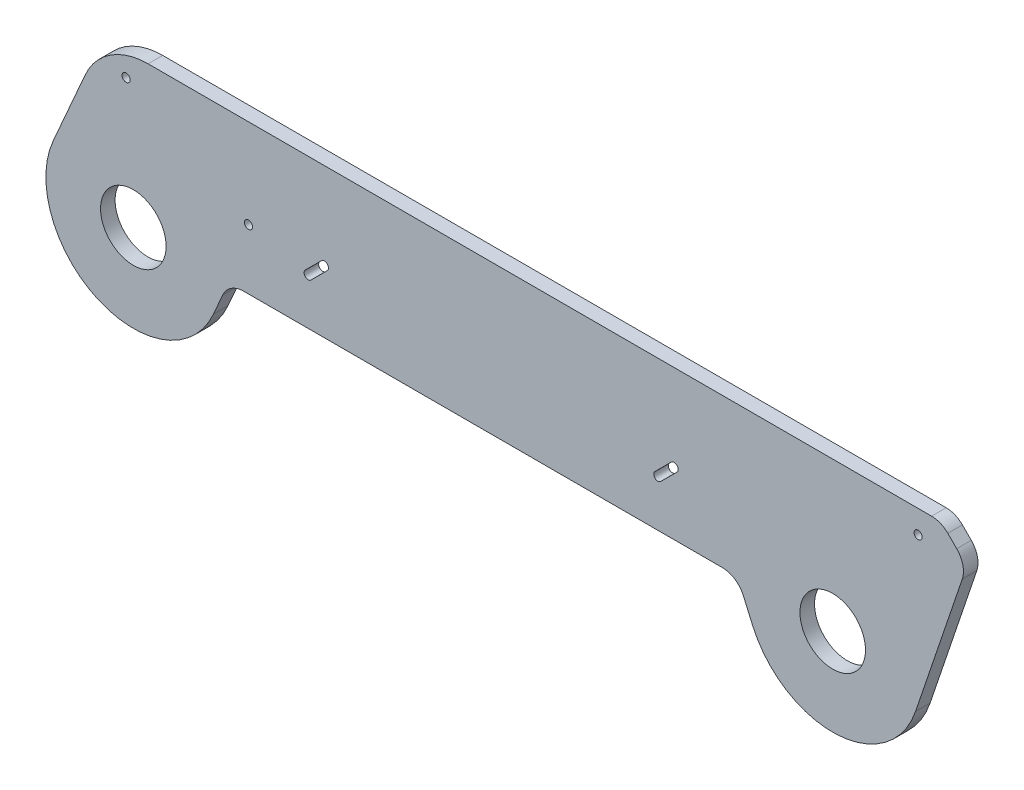
ISO-10303-21;
HEADER;
FILE_DESCRIPTION(('STEP AP214'),'2;1');
FILE_NAME('part.step','',(''),(''),'','','');
FILE_SCHEMA(('AUTOMOTIVE_DESIGN { 1 0 10303 214 1 1 1 1 }'));
ENDSEC;
DATA;
#1=APPLICATION_CONTEXT('core data for automotive mechanical design processes');
#2=APPLICATION_PROTOCOL_DEFINITION('international standard','automotive_design',2000,#1);
#3=PRODUCT_CONTEXT('',#1,'mechanical');
#4=PRODUCT('Part','Part','',(#3));
#5=PRODUCT_RELATED_PRODUCT_CATEGORY('part','',(#4));
#6=PRODUCT_DEFINITION_FORMATION('','',#4);
#7=PRODUCT_DEFINITION_CONTEXT('part definition',#1,'design');
#8=PRODUCT_DEFINITION('design','',#6,#7);
#9=PRODUCT_DEFINITION_SHAPE('','',#8);
#10=(LENGTH_UNIT() NAMED_UNIT(*) SI_UNIT(.MILLI.,.METRE.));
#11=(NAMED_UNIT(*) PLANE_ANGLE_UNIT() SI_UNIT($,.RADIAN.));
#12=(NAMED_UNIT(*) SI_UNIT($,.STERADIAN.) SOLID_ANGLE_UNIT());
#13=UNCERTAINTY_MEASURE_WITH_UNIT(LENGTH_MEASURE(1.E-05),#10,'distance_accuracy_value','');
#14=(GEOMETRIC_REPRESENTATION_CONTEXT(3) GLOBAL_UNCERTAINTY_ASSIGNED_CONTEXT((#13)) GLOBAL_UNIT_ASSIGNED_CONTEXT((#10,
#11,#12)) REPRESENTATION_CONTEXT('',''));
#15=CARTESIAN_POINT('',(0.,0.,0.));
#16=DIRECTION('',(0.,0.,1.));
#17=DIRECTION('',(1.,0.,0.));
#18=AXIS2_PLACEMENT_3D('',#15,#16,#17);
#19=CARTESIAN_POINT('',(0.,0.,6.35));
#20=DIRECTION('',(0.,0.,1.));
#21=DIRECTION('',(1.,0.,0.));
#22=AXIS2_PLACEMENT_3D('',#19,#20,#21);
#23=PLANE('',#22);
#24=CARTESIAN_POINT('',(50.2,26.1640236911096,6.34999999999999));
#25=DIRECTION('',(0.,0.,1.));
#26=DIRECTION('',(1.,0.,0.));
#27=AXIS2_PLACEMENT_3D('',#24,#25,#26);
#28=CIRCLE('',#27,1.778);
#29=CARTESIAN_POINT('',(51.978,26.1640236911096,6.34999999999999));
#30=VERTEX_POINT('',#29);
#31=EDGE_CURVE('E578',#30,#30,#28,.F.);
#32=ORIENTED_EDGE('',*,*,#31,.T.);
#33=EDGE_LOOP('',(#32));
#34=FACE_BOUND('',#33,.T.);
#35=CARTESIAN_POINT('',(0.,0.,6.35));
#36=DIRECTION('',(0.,0.,1.));
#37=DIRECTION('',(1.,0.,0.));
#38=AXIS2_PLACEMENT_3D('',#35,#36,#37);
#39=CIRCLE('',#38,14.2875);
#40=CARTESIAN_POINT('',(14.2875,0.,6.35));
#41=VERTEX_POINT('',#40);
#42=EDGE_CURVE('E397',#41,#41,#39,.T.);
#43=ORIENTED_EDGE('',*,*,#42,.F.);
#44=EDGE_LOOP('',(#43));
#45=FACE_BOUND('',#44,.T.);
#46=CARTESIAN_POINT('',(304.8,0.,6.35));
#47=DIRECTION('',(0.,0.,1.));
#48=DIRECTION('',(1.,0.,0.));
#49=AXIS2_PLACEMENT_3D('',#46,#47,#48);
#50=CIRCLE('',#49,14.2875);
#51=CARTESIAN_POINT('',(319.0875,0.,6.35));
#52=VERTEX_POINT('',#51);
#53=EDGE_CURVE('E400',#52,#52,#50,.T.);
#54=ORIENTED_EDGE('',*,*,#53,.F.);
#55=EDGE_LOOP('',(#54));
#56=FACE_BOUND('',#55,.T.);
#57=DIRECTION('',(-0.707106781186547,-0.707106781186548,0.));
#58=VECTOR('',#57,1.);
#59=CARTESIAN_POINT('',(227.34276414305,21.5848354973704,6.35));
#60=LINE('',#59,#58);
#61=CARTESIAN_POINT('',(234.413831954916,28.6559033092359,6.35));
#62=VERTEX_POINT('',#61);
#63=CARTESIAN_POINT('',(227.34276414305,21.5848354973704,6.35));
#64=VERTEX_POINT('',#63);
#65=EDGE_CURVE('E604',#62,#64,#60,.T.);
#66=ORIENTED_EDGE('',*,*,#65,.F.);
#67=CARTESIAN_POINT('',(235.671067811866,27.3986674522862,6.35));
#68=DIRECTION('',(0.,0.,1.));
#69=DIRECTION('',(1.,0.,0.));
#70=AXIS2_PLACEMENT_3D('',#67,#68,#69);
#71=CIRCLE('',#70,1.77799999999999);
#72=CARTESIAN_POINT('',(236.928303668815,26.1414315953365,6.35));
#73=VERTEX_POINT('',#72);
#74=EDGE_CURVE('E601',#73,#62,#71,.T.);
#75=ORIENTED_EDGE('',*,*,#74,.F.);
#76=DIRECTION('',(0.707106781186547,0.707106781186547,0.));
#77=VECTOR('',#76,1.);
#78=CARTESIAN_POINT('',(229.85723585695,19.070363783471,6.35));
#79=LINE('',#78,#77);
#80=CARTESIAN_POINT('',(229.85723585695,19.070363783471,6.35));
#81=VERTEX_POINT('',#80);
#82=EDGE_CURVE('E583',#81,#73,#79,.T.);
#83=ORIENTED_EDGE('',*,*,#82,.F.);
#84=CARTESIAN_POINT('',(228.6,20.3275996404207,6.35));
#85=DIRECTION('',(0.,0.,1.));
#86=DIRECTION('',(1.,0.,0.));
#87=AXIS2_PLACEMENT_3D('',#84,#85,#86);
#88=CIRCLE('',#87,1.77800000000001);
#89=EDGE_CURVE('E616',#64,#81,#88,.T.);
#90=ORIENTED_EDGE('',*,*,#89,.F.);
#91=EDGE_LOOP('',(#66,#75,#83,#90));
#92=FACE_BOUND('',#91,.T.);
#93=DIRECTION('',(-0.707106781186548,-0.707106781186547,0.));
#94=VECTOR('',#93,1.);
#95=CARTESIAN_POINT('',(74.9427641430503,21.4212595480593,6.35));
#96=LINE('',#95,#94);
#97=CARTESIAN_POINT('',(82.0138319549158,28.4923273599247,6.35));
#98=VERTEX_POINT('',#97);
#99=CARTESIAN_POINT('',(74.9427641430503,21.4212595480593,6.35));
#100=VERTEX_POINT('',#99);
#101=EDGE_CURVE('E592',#98,#100,#96,.T.);
#102=ORIENTED_EDGE('',*,*,#101,.F.);
#103=CARTESIAN_POINT('',(83.2710678118655,27.2350915029751,6.35));
#104=DIRECTION('',(0.,0.,1.));
#105=DIRECTION('',(1.,0.,0.));
#106=AXIS2_PLACEMENT_3D('',#103,#104,#105);
#107=CIRCLE('',#106,1.778);
#108=CARTESIAN_POINT('',(84.5283036688151,25.9778556460254,6.35));
#109=VERTEX_POINT('',#108);
#110=EDGE_CURVE('E588',#109,#98,#107,.T.);
#111=ORIENTED_EDGE('',*,*,#110,.F.);
#112=DIRECTION('',(0.707106781186547,0.707106781186548,0.));
#113=VECTOR('',#112,1.);
#114=CARTESIAN_POINT('',(77.4572358569497,18.9067878341599,6.35));
#115=LINE('',#114,#113);
#116=CARTESIAN_POINT('',(77.4572358569497,18.9067878341599,6.35));
#117=VERTEX_POINT('',#116);
#118=EDGE_CURVE('E585',#117,#109,#115,.T.);
#119=ORIENTED_EDGE('',*,*,#118,.F.);
#120=CARTESIAN_POINT('',(76.2,20.1640236911096,6.35));
#121=DIRECTION('',(0.,0.,1.));
#122=DIRECTION('',(1.,0.,0.));
#123=AXIS2_PLACEMENT_3D('',#120,#121,#122);
#124=CIRCLE('',#123,1.77800000000001);
#125=EDGE_CURVE('E427',#100,#117,#124,.T.);
#126=ORIENTED_EDGE('',*,*,#125,.F.);
#127=EDGE_LOOP('',(#102,#111,#119,#126));
#128=FACE_BOUND('',#127,.T.);
#129=CARTESIAN_POINT('',(342.032717470029,55.,6.35));
#130=DIRECTION('',(0.,0.,-1.));
#131=DIRECTION('',(-1.,0.,0.));
#132=AXIS2_PLACEMENT_3D('',#129,#130,#131);
#133=CIRCLE('',#132,1.77800000000004);
#134=CARTESIAN_POINT('',(340.254717470029,55.,6.35));
#135=VERTEX_POINT('',#134);
#136=EDGE_CURVE('E385',#135,#135,#133,.T.);
#137=ORIENTED_EDGE('',*,*,#136,.T.);
#138=EDGE_LOOP('',(#137));
#139=FACE_BOUND('',#138,.T.);
#140=CARTESIAN_POINT('',(-3.15136382807367,55.,6.35));
#141=DIRECTION('',(0.,0.,-1.));
#142=DIRECTION('',(1.,0.,0.));
#143=AXIS2_PLACEMENT_3D('',#140,#141,#142);
#144=CIRCLE('',#143,1.77800000000003);
#145=CARTESIAN_POINT('',(-1.37336382807363,55.,6.35));
#146=VERTEX_POINT('',#145);
#147=EDGE_CURVE('E392',#146,#146,#144,.T.);
#148=ORIENTED_EDGE('',*,*,#147,.T.);
#149=EDGE_LOOP('',(#148));
#150=FACE_BOUND('',#149,.T.);
#151=DIRECTION('',(-0.400786044835318,-0.9161716794713,0.));
#152=VECTOR('',#151,1.);
#153=CARTESIAN_POINT('',(34.9061409878566,-15.2699483082256,6.35));
#154=LINE('',#153,#152);
#155=CARTESIAN_POINT('',(38.9647867194442,-5.99213955164683,6.35));
#156=VERTEX_POINT('',#155);
#157=CARTESIAN_POINT('',(34.9061409878565,-15.2699483082256,6.35));
#158=VERTEX_POINT('',#157);
#159=EDGE_CURVE('E572',#156,#158,#154,.T.);
#160=ORIENTED_EDGE('',*,*,#159,.F.);
#161=CARTESIAN_POINT('',(48.1265035141572,-10.,6.35));
#162=DIRECTION('',(0.,0.,1.));
#163=DIRECTION('',(1.,0.,0.));
#164=AXIS2_PLACEMENT_3D('',#161,#162,#163);
#165=CIRCLE('',#164,10.);
#166=CARTESIAN_POINT('',(48.1265035141572,0.,6.35));
#167=VERTEX_POINT('',#166);
#168=EDGE_CURVE('E12',#156,#167,#165,.F.);
#169=ORIENTED_EDGE('',*,*,#168,.T.);
#170=DIRECTION('',(1.,0.,0.));
#171=VECTOR('',#170,1.);
#172=CARTESIAN_POINT('',(0.,0.,6.35));
#173=LINE('',#172,#171);
#174=CARTESIAN_POINT('',(256.673496485843,0.,6.35));
#175=VERTEX_POINT('',#174);
#176=EDGE_CURVE('E489',#167,#175,#173,.T.);
#177=ORIENTED_EDGE('',*,*,#176,.T.);
#178=CARTESIAN_POINT('',(256.673496485843,-10.,6.35));
#179=DIRECTION('',(0.,0.,1.));
#180=DIRECTION('',(1.,0.,0.));
#181=AXIS2_PLACEMENT_3D('',#178,#179,#180);
#182=CIRCLE('',#181,10.);
#183=CARTESIAN_POINT('',(265.835213280556,-5.99213955164687,6.35));
#184=VERTEX_POINT('',#183);
#185=EDGE_CURVE('E332',#175,#184,#182,.F.);
#186=ORIENTED_EDGE('',*,*,#185,.T.);
#187=DIRECTION('',(-0.400786044835318,0.9161716794713,0.));
#188=VECTOR('',#187,1.);
#189=CARTESIAN_POINT('',(220.934001513796,96.6492051876703,6.35));
#190=LINE('',#189,#188);
#191=CARTESIAN_POINT('',(269.893859012144,-15.2699483082256,6.35));
#192=VERTEX_POINT('',#191);
#193=EDGE_CURVE('E325',#192,#184,#190,.T.);
#194=ORIENTED_EDGE('',*,*,#193,.F.);
#195=CARTESIAN_POINT('',(304.8,0.,6.35));
#196=DIRECTION('',(0.,0.,1.));
#197=DIRECTION('',(1.,0.,0.));
#198=AXIS2_PLACEMENT_3D('',#195,#196,#197);
#199=CIRCLE('',#198,38.1);
#200=CARTESIAN_POINT('',(340.887568868309,-12.2187304240265,6.35));
#201=VERTEX_POINT('',#200);
#202=EDGE_CURVE('E329',#192,#201,#199,.T.);
#203=ORIENTED_EDGE('',*,*,#202,.T.);
#204=DIRECTION('',(-0.320701585932455,-0.947180285257463,0.));
#205=VECTOR('',#204,1.);
#206=CARTESIAN_POINT('',(309.539039067778,-104.805454972134,6.35));
#207=LINE('',#206,#205);
#208=CARTESIAN_POINT('',(361.246056934502,47.9093119050462,6.35));
#209=VERTEX_POINT('',#208);
#210=EDGE_CURVE('E369',#209,#201,#207,.T.);
#211=ORIENTED_EDGE('',*,*,#210,.F.);
#212=CARTESIAN_POINT('',(351.774254081928,51.1163277643707,6.35000000000002));
#213=DIRECTION('',(0.,0.,1.));
#214=DIRECTION('',(1.,0.,0.));
#215=AXIS2_PLACEMENT_3D('',#212,#213,#214);
#216=CIRCLE('',#215,10.);
#217=CARTESIAN_POINT('',(358.845321893793,58.1873955762362,6.35));
#218=VERTEX_POINT('',#217);
#219=EDGE_CURVE('E440',#209,#218,#216,.T.);
#220=ORIENTED_EDGE('',*,*,#219,.T.);
#221=DIRECTION('',(-0.707106781186552,0.707106781186543,0.));
#222=VECTOR('',#221,1.);
#223=CARTESIAN_POINT('',(208.516358735012,208.516358735015,6.35));
#224=LINE('',#223,#222);
#225=CARTESIAN_POINT('',(354.961649658164,62.0710678118655,6.35));
#226=VERTEX_POINT('',#225);
#227=EDGE_CURVE('E423',#218,#226,#224,.T.);
#228=ORIENTED_EDGE('',*,*,#227,.T.);
#229=CARTESIAN_POINT('',(347.890581846298,55.,6.35));
#230=DIRECTION('',(0.,0.,1.));
#231=DIRECTION('',(1.,0.,0.));
#232=AXIS2_PLACEMENT_3D('',#229,#230,#231);
#233=CIRCLE('',#232,10.);
#234=CARTESIAN_POINT('',(347.890581846298,65.,6.35));
#235=VERTEX_POINT('',#234);
#236=EDGE_CURVE('E438',#226,#235,#233,.T.);
#237=ORIENTED_EDGE('',*,*,#236,.T.);
#238=DIRECTION('',(1.,0.,0.));
#239=VECTOR('',#238,1.);
#240=CARTESIAN_POINT('',(0.,65.,6.35));
#241=LINE('',#240,#239);
#242=CARTESIAN_POINT('',(6.46986989671709,65.,6.35));
#243=VERTEX_POINT('',#242);
#244=EDGE_CURVE('E404',#243,#235,#241,.T.);
#245=ORIENTED_EDGE('',*,*,#244,.F.);
#246=CARTESIAN_POINT('',(6.46986989671709,35.,6.35));
#247=DIRECTION('',(0.,0.,1.));
#248=DIRECTION('',(1.,0.,0.));
#249=AXIS2_PLACEMENT_3D('',#246,#247,#248);
#250=CIRCLE('',#249,30.);
#251=CARTESIAN_POINT('',(-21.0152804874219,47.0235813450595,6.35));
#252=VERTEX_POINT('',#251);
#253=EDGE_CURVE('E417',#243,#252,#250,.T.);
#254=ORIENTED_EDGE('',*,*,#253,.T.);
#255=DIRECTION('',(-0.400786044835317,-0.9161716794713,0.));
#256=VECTOR('',#255,1.);
#257=CARTESIAN_POINT('',(-34.9061409878565,15.2699483082256,6.35));
#258=LINE('',#257,#256);
#259=CARTESIAN_POINT('',(-34.9061409878565,15.2699483082256,6.35));
#260=VERTEX_POINT('',#259);
#261=EDGE_CURVE('E358',#252,#260,#258,.T.);
#262=ORIENTED_EDGE('',*,*,#261,.T.);
#263=CARTESIAN_POINT('',(0.,0.,6.35));
#264=DIRECTION('',(0.,0.,1.));
#265=DIRECTION('',(1.,0.,0.));
#266=AXIS2_PLACEMENT_3D('',#263,#264,#265);
#267=CIRCLE('',#266,38.1);
#268=EDGE_CURVE('E352',#260,#158,#267,.T.);
#269=ORIENTED_EDGE('',*,*,#268,.T.);
#270=EDGE_LOOP('',(#160,#169,#177,#186,#194,#203,#211,#220,#228,#237,#245,#254,#262,#269));
#271=FACE_BOUND('',#270,.T.);
#272=ADVANCED_FACE('F179',(#34,#45,#56,#92,#128,#139,#150,#271),#23,.T.);
#273=CARTESIAN_POINT('',(0.,0.,0.));
#274=DIRECTION('',(0.,0.,1.));
#275=DIRECTION('',(1.,0.,0.));
#276=AXIS2_PLACEMENT_3D('',#273,#274,#275);
#277=PLANE('',#276);
#278=CARTESIAN_POINT('',(342.032717470029,55.,0.));
#279=DIRECTION('',(0.,0.,-1.));
#280=DIRECTION('',(-1.,0.,0.));
#281=AXIS2_PLACEMENT_3D('',#278,#279,#280);
#282=CIRCLE('',#281,1.77800000000004);
#283=CARTESIAN_POINT('',(340.254717470029,55.,0.));
#284=VERTEX_POINT('',#283);
#285=EDGE_CURVE('E389',#284,#284,#282,.T.);
#286=ORIENTED_EDGE('',*,*,#285,.F.);
#287=EDGE_LOOP('',(#286));
#288=FACE_BOUND('',#287,.T.);
#289=CARTESIAN_POINT('',(-3.15136382807367,55.,0.));
#290=DIRECTION('',(0.,0.,-1.));
#291=DIRECTION('',(1.,0.,0.));
#292=AXIS2_PLACEMENT_3D('',#289,#290,#291);
#293=CIRCLE('',#292,1.77800000000003);
#294=CARTESIAN_POINT('',(-1.37336382807363,55.,0.));
#295=VERTEX_POINT('',#294);
#296=EDGE_CURVE('E384',#295,#295,#293,.T.);
#297=ORIENTED_EDGE('',*,*,#296,.F.);
#298=EDGE_LOOP('',(#297));
#299=FACE_BOUND('',#298,.T.);
#300=CARTESIAN_POINT('',(83.2710678118655,27.2350915029751,0.));
#301=DIRECTION('',(0.,0.,1.));
#302=DIRECTION('',(1.,0.,0.));
#303=AXIS2_PLACEMENT_3D('',#300,#301,#302);
#304=CIRCLE('',#303,1.778);
#305=CARTESIAN_POINT('',(84.5283036688151,25.9778556460254,0.));
#306=VERTEX_POINT('',#305);
#307=CARTESIAN_POINT('',(82.0138319549158,28.4923273599247,0.));
#308=VERTEX_POINT('',#307);
#309=EDGE_CURVE('E363',#306,#308,#304,.T.);
#310=ORIENTED_EDGE('',*,*,#309,.T.);
#311=DIRECTION('',(-0.707106781186548,-0.707106781186547,0.));
#312=VECTOR('',#311,1.);
#313=CARTESIAN_POINT('',(26.7607522974954,-26.7607522974955,0.));
#314=LINE('',#313,#312);
#315=CARTESIAN_POINT('',(74.9427641430503,21.4212595480593,0.));
#316=VERTEX_POINT('',#315);
#317=EDGE_CURVE('E610',#308,#316,#314,.T.);
#318=ORIENTED_EDGE('',*,*,#317,.T.);
#319=CARTESIAN_POINT('',(76.2,20.1640236911096,0.));
#320=DIRECTION('',(0.,0.,1.));
#321=DIRECTION('',(1.,0.,0.));
#322=AXIS2_PLACEMENT_3D('',#319,#320,#321);
#323=CIRCLE('',#322,1.77800000000001);
#324=CARTESIAN_POINT('',(77.4572358569497,18.9067878341599,0.));
#325=VERTEX_POINT('',#324);
#326=EDGE_CURVE('E377',#316,#325,#323,.T.);
#327=ORIENTED_EDGE('',*,*,#326,.T.);
#328=DIRECTION('',(0.707106781186547,0.707106781186548,0.));
#329=VECTOR('',#328,1.);
#330=CARTESIAN_POINT('',(29.275224011395,-29.2752240113949,0.));
#331=LINE('',#330,#329);
#332=EDGE_CURVE('E597',#325,#306,#331,.T.);
#333=ORIENTED_EDGE('',*,*,#332,.T.);
#334=EDGE_LOOP('',(#310,#318,#327,#333));
#335=FACE_BOUND('',#334,.T.);
#336=CARTESIAN_POINT('',(235.671067811866,27.3986674522862,0.));
#337=DIRECTION('',(0.,0.,1.));
#338=DIRECTION('',(1.,0.,0.));
#339=AXIS2_PLACEMENT_3D('',#336,#337,#338);
#340=CIRCLE('',#339,1.77799999999999);
#341=CARTESIAN_POINT('',(236.928303668815,26.1414315953365,0.));
#342=VERTEX_POINT('',#341);
#343=CARTESIAN_POINT('',(234.413831954916,28.6559033092359,0.));
#344=VERTEX_POINT('',#343);
#345=EDGE_CURVE('E462',#342,#344,#340,.T.);
#346=ORIENTED_EDGE('',*,*,#345,.T.);
#347=DIRECTION('',(-0.707106781186547,-0.707106781186548,0.));
#348=VECTOR('',#347,1.);
#349=CARTESIAN_POINT('',(102.87896432284,-102.87896432284,0.));
#350=LINE('',#349,#348);
#351=CARTESIAN_POINT('',(227.34276414305,21.5848354973704,0.));
#352=VERTEX_POINT('',#351);
#353=EDGE_CURVE('E614',#344,#352,#350,.T.);
#354=ORIENTED_EDGE('',*,*,#353,.T.);
#355=CARTESIAN_POINT('',(228.6,20.3275996404207,0.));
#356=DIRECTION('',(0.,0.,1.));
#357=DIRECTION('',(1.,0.,0.));
#358=AXIS2_PLACEMENT_3D('',#355,#356,#357);
#359=CIRCLE('',#358,1.77800000000001);
#360=CARTESIAN_POINT('',(229.85723585695,19.070363783471,0.));
#361=VERTEX_POINT('',#360);
#362=EDGE_CURVE('E424',#352,#361,#359,.T.);
#363=ORIENTED_EDGE('',*,*,#362,.T.);
#364=DIRECTION('',(0.707106781186548,0.707106781186548,0.));
#365=VECTOR('',#364,1.);
#366=CARTESIAN_POINT('',(105.393436036739,-105.393436036739,0.));
#367=LINE('',#366,#365);
#368=EDGE_CURVE('E612',#361,#342,#367,.T.);
#369=ORIENTED_EDGE('',*,*,#368,.T.);
#370=EDGE_LOOP('',(#346,#354,#363,#369));
#371=FACE_BOUND('',#370,.T.);
#372=CARTESIAN_POINT('',(0.,0.,0.));
#373=DIRECTION('',(0.,0.,1.));
#374=DIRECTION('',(1.,0.,0.));
#375=AXIS2_PLACEMENT_3D('',#372,#373,#374);
#376=CIRCLE('',#375,14.2875);
#377=CARTESIAN_POINT('',(14.2875,0.,0.));
#378=VERTEX_POINT('',#377);
#379=EDGE_CURVE('E388',#378,#378,#376,.T.);
#380=ORIENTED_EDGE('',*,*,#379,.T.);
#381=EDGE_LOOP('',(#380));
#382=FACE_BOUND('',#381,.T.);
#383=CARTESIAN_POINT('',(304.8,0.,0.));
#384=DIRECTION('',(0.,0.,1.));
#385=DIRECTION('',(1.,0.,0.));
#386=AXIS2_PLACEMENT_3D('',#383,#384,#385);
#387=CIRCLE('',#386,14.2875);
#388=CARTESIAN_POINT('',(319.0875,0.,0.));
#389=VERTEX_POINT('',#388);
#390=EDGE_CURVE('E410',#389,#389,#387,.T.);
#391=ORIENTED_EDGE('',*,*,#390,.T.);
#392=EDGE_LOOP('',(#391));
#393=FACE_BOUND('',#392,.T.);
#394=CARTESIAN_POINT('',(50.2,26.1640236911096,0.));
#395=DIRECTION('',(0.,0.,-1.));
#396=DIRECTION('',(-1.,0.,0.));
#397=AXIS2_PLACEMENT_3D('',#394,#395,#396);
#398=CIRCLE('',#397,1.778);
#399=CARTESIAN_POINT('',(48.422,26.1640236911096,0.));
#400=VERTEX_POINT('',#399);
#401=EDGE_CURVE('E574',#400,#400,#398,.T.);
#402=ORIENTED_EDGE('',*,*,#401,.F.);
#403=EDGE_LOOP('',(#402));
#404=FACE_BOUND('',#403,.T.);
#405=DIRECTION('',(1.,0.,0.));
#406=VECTOR('',#405,1.);
#407=CARTESIAN_POINT('',(0.,0.,0.));
#408=LINE('',#407,#406);
#409=CARTESIAN_POINT('',(48.1265035141572,0.,0.));
#410=VERTEX_POINT('',#409);
#411=CARTESIAN_POINT('',(256.673496485843,0.,0.));
#412=VERTEX_POINT('',#411);
#413=EDGE_CURVE('E335',#410,#412,#408,.T.);
#414=ORIENTED_EDGE('',*,*,#413,.F.);
#415=CARTESIAN_POINT('',(48.1265035141572,-10.,0.));
#416=DIRECTION('',(0.,0.,1.));
#417=DIRECTION('',(1.,0.,0.));
#418=AXIS2_PLACEMENT_3D('',#415,#416,#417);
#419=CIRCLE('',#418,10.);
#420=CARTESIAN_POINT('',(38.9647867194442,-5.99213955164683,0.));
#421=VERTEX_POINT('',#420);
#422=EDGE_CURVE('E187',#410,#421,#419,.T.);
#423=ORIENTED_EDGE('',*,*,#422,.T.);
#424=DIRECTION('',(-0.400786044835318,-0.9161716794713,0.));
#425=VECTOR('',#424,1.);
#426=CARTESIAN_POINT('',(34.9061409878566,-15.2699483082256,0.));
#427=LINE('',#426,#425);
#428=CARTESIAN_POINT('',(34.9061409878565,-15.2699483082256,0.));
#429=VERTEX_POINT('',#428);
#430=EDGE_CURVE('E575',#421,#429,#427,.T.);
#431=ORIENTED_EDGE('',*,*,#430,.T.);
#432=CARTESIAN_POINT('',(0.,0.,0.));
#433=DIRECTION('',(0.,0.,1.));
#434=DIRECTION('',(1.,0.,0.));
#435=AXIS2_PLACEMENT_3D('',#432,#433,#434);
#436=CIRCLE('',#435,38.1);
#437=CARTESIAN_POINT('',(-34.9061409878565,15.2699483082256,0.));
#438=VERTEX_POINT('',#437);
#439=EDGE_CURVE('E382',#429,#438,#436,.F.);
#440=ORIENTED_EDGE('',*,*,#439,.T.);
#441=DIRECTION('',(0.400786044835317,0.9161716794713,0.));
#442=VECTOR('',#441,1.);
#443=CARTESIAN_POINT('',(-34.9061409878565,15.2699483082256,0.));
#444=LINE('',#443,#442);
#445=CARTESIAN_POINT('',(-21.0152804874219,47.0235813450595,0.));
#446=VERTEX_POINT('',#445);
#447=EDGE_CURVE('E351',#438,#446,#444,.T.);
#448=ORIENTED_EDGE('',*,*,#447,.T.);
#449=CARTESIAN_POINT('',(6.46986989671709,35.,0.));
#450=DIRECTION('',(0.,0.,1.));
#451=DIRECTION('',(1.,0.,0.));
#452=AXIS2_PLACEMENT_3D('',#449,#450,#451);
#453=CIRCLE('',#452,30.);
#454=CARTESIAN_POINT('',(6.46986989671709,65.,0.));
#455=VERTEX_POINT('',#454);
#456=EDGE_CURVE('E421',#446,#455,#453,.F.);
#457=ORIENTED_EDGE('',*,*,#456,.T.);
#458=DIRECTION('',(1.,0.,0.));
#459=VECTOR('',#458,1.);
#460=CARTESIAN_POINT('',(0.,65.,0.));
#461=LINE('',#460,#459);
#462=CARTESIAN_POINT('',(347.890581846298,65.,0.));
#463=VERTEX_POINT('',#462);
#464=EDGE_CURVE('E401',#455,#463,#461,.T.);
#465=ORIENTED_EDGE('',*,*,#464,.T.);
#466=CARTESIAN_POINT('',(347.890581846298,55.,0.));
#467=DIRECTION('',(0.,0.,1.));
#468=DIRECTION('',(1.,0.,0.));
#469=AXIS2_PLACEMENT_3D('',#466,#467,#468);
#470=CIRCLE('',#469,10.);
#471=CARTESIAN_POINT('',(354.961649658164,62.0710678118655,0.));
#472=VERTEX_POINT('',#471);
#473=EDGE_CURVE('E446',#463,#472,#470,.F.);
#474=ORIENTED_EDGE('',*,*,#473,.T.);
#475=DIRECTION('',(0.707106781186552,-0.707106781186543,0.));
#476=VECTOR('',#475,1.);
#477=CARTESIAN_POINT('',(363.238575524872,53.7941419451578,0.));
#478=LINE('',#477,#476);
#479=CARTESIAN_POINT('',(358.845321893793,58.1873955762362,0.));
#480=VERTEX_POINT('',#479);
#481=EDGE_CURVE('E432',#472,#480,#478,.T.);
#482=ORIENTED_EDGE('',*,*,#481,.T.);
#483=CARTESIAN_POINT('',(351.774254081928,51.1163277643707,0.));
#484=DIRECTION('',(0.,0.,1.));
#485=DIRECTION('',(1.,0.,0.));
#486=AXIS2_PLACEMENT_3D('',#483,#484,#485);
#487=CIRCLE('',#486,10.);
#488=CARTESIAN_POINT('',(361.246056934502,47.9093119050462,0.));
#489=VERTEX_POINT('',#488);
#490=EDGE_CURVE('E448',#480,#489,#487,.F.);
#491=ORIENTED_EDGE('',*,*,#490,.T.);
#492=DIRECTION('',(0.320701585932455,0.947180285257463,0.));
#493=VECTOR('',#492,1.);
#494=CARTESIAN_POINT('',(309.539039067778,-104.805454972134,0.));
#495=LINE('',#494,#493);
#496=CARTESIAN_POINT('',(340.887568868309,-12.2187304240265,0.));
#497=VERTEX_POINT('',#496);
#498=EDGE_CURVE('E376',#497,#489,#495,.T.);
#499=ORIENTED_EDGE('',*,*,#498,.F.);
#500=CARTESIAN_POINT('',(304.8,0.,0.));
#501=DIRECTION('',(0.,0.,1.));
#502=DIRECTION('',(1.,0.,0.));
#503=AXIS2_PLACEMENT_3D('',#500,#501,#502);
#504=CIRCLE('',#503,38.1);
#505=CARTESIAN_POINT('',(269.893859012144,-15.2699483082256,0.));
#506=VERTEX_POINT('',#505);
#507=EDGE_CURVE('E355',#497,#506,#504,.F.);
#508=ORIENTED_EDGE('',*,*,#507,.T.);
#509=DIRECTION('',(-0.400786044835318,0.9161716794713,0.));
#510=VECTOR('',#509,1.);
#511=CARTESIAN_POINT('',(220.934001513796,96.6492051876703,0.));
#512=LINE('',#511,#510);
#513=CARTESIAN_POINT('',(265.835213280556,-5.99213955164687,0.));
#514=VERTEX_POINT('',#513);
#515=EDGE_CURVE('E336',#506,#514,#512,.T.);
#516=ORIENTED_EDGE('',*,*,#515,.T.);
#517=CARTESIAN_POINT('',(256.673496485843,-10.,0.));
#518=DIRECTION('',(0.,0.,1.));
#519=DIRECTION('',(1.,0.,0.));
#520=AXIS2_PLACEMENT_3D('',#517,#518,#519);
#521=CIRCLE('',#520,10.);
#522=EDGE_CURVE('E484',#514,#412,#521,.T.);
#523=ORIENTED_EDGE('',*,*,#522,.T.);
#524=EDGE_LOOP('',(#414,#423,#431,#440,#448,#457,#465,#474,#482,#491,#499,#508,#516,#523));
#525=FACE_BOUND('',#524,.T.);
#526=ADVANCED_FACE('F486',(#288,#299,#335,#371,#382,#393,#404,#525),#277,.F.);
#527=CARTESIAN_POINT('',(304.8,0.,-418.839938866449));
#528=DIRECTION('',(0.,0.,1.));
#529=DIRECTION('',(1.,0.,0.));
#530=AXIS2_PLACEMENT_3D('',#527,#528,#529);
#531=CYLINDRICAL_SURFACE('',#530,38.1);
#532=ORIENTED_EDGE('',*,*,#202,.F.);
#533=DIRECTION('',(0.,0.,1.));
#534=VECTOR('',#533,1.);
#535=CARTESIAN_POINT('',(269.893859012144,-15.2699483082256,-391.826863084727));
#536=LINE('',#535,#534);
#537=EDGE_CURVE('E339',#506,#192,#536,.T.);
#538=ORIENTED_EDGE('',*,*,#537,.F.);
#539=ORIENTED_EDGE('',*,*,#507,.F.);
#540=DIRECTION('',(0.,0.,1.));
#541=VECTOR('',#540,1.);
#542=CARTESIAN_POINT('',(340.887568868309,-12.2187304240265,-418.839938866449));
#543=LINE('',#542,#541);
#544=EDGE_CURVE('E350',#497,#201,#543,.T.);
#545=ORIENTED_EDGE('',*,*,#544,.T.);
#546=EDGE_LOOP('',(#532,#538,#539,#545));
#547=FACE_BOUND('',#546,.T.);
#548=ADVANCED_FACE('F348',(#547),#531,.T.);
#549=CARTESIAN_POINT('',(228.6,20.3275996404207,-3.65));
#550=DIRECTION('',(0.,0.,1.));
#551=DIRECTION('',(1.,0.,0.));
#552=AXIS2_PLACEMENT_3D('',#549,#550,#551);
#553=CYLINDRICAL_SURFACE('',#552,1.77800000000001);
#554=DIRECTION('',(0.,0.,1.));
#555=VECTOR('',#554,1.);
#556=CARTESIAN_POINT('',(227.34276414305,21.5848354973704,-3.65));
#557=LINE('',#556,#555);
#558=EDGE_CURVE('E461',#64,#352,#557,.F.);
#559=ORIENTED_EDGE('',*,*,#558,.F.);
#560=ORIENTED_EDGE('',*,*,#89,.T.);
#561=DIRECTION('',(0.,0.,1.));
#562=VECTOR('',#561,1.);
#563=CARTESIAN_POINT('',(229.85723585695,19.070363783471,-3.65));
#564=LINE('',#563,#562);
#565=EDGE_CURVE('E458',#81,#361,#564,.F.);
#566=ORIENTED_EDGE('',*,*,#565,.T.);
#567=ORIENTED_EDGE('',*,*,#362,.F.);
#568=EDGE_LOOP('',(#559,#560,#566,#567));
#569=FACE_BOUND('',#568,.T.);
#570=ADVANCED_FACE('F622',(#569),#553,.F.);
#571=CARTESIAN_POINT('',(76.2,20.1640236911096,-3.65));
#572=DIRECTION('',(0.,0.,1.));
#573=DIRECTION('',(1.,0.,0.));
#574=AXIS2_PLACEMENT_3D('',#571,#572,#573);
#575=CYLINDRICAL_SURFACE('',#574,1.77800000000001);
#576=DIRECTION('',(0.,0.,1.));
#577=VECTOR('',#576,1.);
#578=CARTESIAN_POINT('',(74.9427641430503,21.4212595480593,-3.65));
#579=LINE('',#578,#577);
#580=EDGE_CURVE('E456',#100,#316,#579,.F.);
#581=ORIENTED_EDGE('',*,*,#580,.F.);
#582=ORIENTED_EDGE('',*,*,#125,.T.);
#583=DIRECTION('',(0.,0.,1.));
#584=VECTOR('',#583,1.);
#585=CARTESIAN_POINT('',(77.4572358569497,18.9067878341599,-3.65));
#586=LINE('',#585,#584);
#587=EDGE_CURVE('E453',#117,#325,#586,.F.);
#588=ORIENTED_EDGE('',*,*,#587,.T.);
#589=ORIENTED_EDGE('',*,*,#326,.F.);
#590=EDGE_LOOP('',(#581,#582,#588,#589));
#591=FACE_BOUND('',#590,.T.);
#592=ADVANCED_FACE('F520',(#591),#575,.F.);
#593=CARTESIAN_POINT('',(0.,65.,6.35));
#594=DIRECTION('',(0.,1.,0.));
#595=DIRECTION('',(0.,0.,1.));
#596=AXIS2_PLACEMENT_3D('',#593,#594,#595);
#597=PLANE('',#596);
#598=ORIENTED_EDGE('',*,*,#244,.T.);
#599=DIRECTION('',(0.,0.,-1.));
#600=VECTOR('',#599,1.);
#601=CARTESIAN_POINT('',(347.890581846298,65.,6.35));
#602=LINE('',#601,#600);
#603=EDGE_CURVE('E450',#235,#463,#602,.T.);
#604=ORIENTED_EDGE('',*,*,#603,.T.);
#605=ORIENTED_EDGE('',*,*,#464,.F.);
#606=DIRECTION('',(0.,0.,1.));
#607=VECTOR('',#606,1.);
#608=CARTESIAN_POINT('',(6.46986989671709,65.,6.35));
#609=LINE('',#608,#607);
#610=EDGE_CURVE('E407',#455,#243,#609,.T.);
#611=ORIENTED_EDGE('',*,*,#610,.T.);
#612=EDGE_LOOP('',(#598,#604,#605,#611));
#613=FACE_BOUND('',#612,.T.);
#614=ADVANCED_FACE('F516',(#613),#597,.T.);
#615=CARTESIAN_POINT('',(304.8,0.,6.35));
#616=DIRECTION('',(0.,0.,-1.));
#617=DIRECTION('',(-1.,0.,0.));
#618=AXIS2_PLACEMENT_3D('',#615,#616,#617);
#619=CYLINDRICAL_SURFACE('',#618,14.2875);
#620=ORIENTED_EDGE('',*,*,#53,.T.);
#621=EDGE_LOOP('',(#620));
#622=FACE_BOUND('',#621,.T.);
#623=ORIENTED_EDGE('',*,*,#390,.F.);
#624=EDGE_LOOP('',(#623));
#625=FACE_BOUND('',#624,.T.);
#626=ADVANCED_FACE('F519',(#622,#625),#619,.F.);
#627=CARTESIAN_POINT('',(0.,0.,6.35));
#628=DIRECTION('',(0.,0.,-1.));
#629=DIRECTION('',(-1.,0.,0.));
#630=AXIS2_PLACEMENT_3D('',#627,#628,#629);
#631=CYLINDRICAL_SURFACE('',#630,14.2875);
#632=ORIENTED_EDGE('',*,*,#42,.T.);
#633=EDGE_LOOP('',(#632));
#634=FACE_BOUND('',#633,.T.);
#635=ORIENTED_EDGE('',*,*,#379,.F.);
#636=EDGE_LOOP('',(#635));
#637=FACE_BOUND('',#636,.T.);
#638=ADVANCED_FACE('F524',(#634,#637),#631,.F.);
#639=CARTESIAN_POINT('',(342.032717470029,55.,6.35));
#640=DIRECTION('',(0.,0.,-1.));
#641=DIRECTION('',(-1.,0.,0.));
#642=AXIS2_PLACEMENT_3D('',#639,#640,#641);
#643=CYLINDRICAL_SURFACE('',#642,1.77800000000004);
#644=ORIENTED_EDGE('',*,*,#136,.F.);
#645=EDGE_LOOP('',(#644));
#646=FACE_BOUND('',#645,.T.);
#647=ORIENTED_EDGE('',*,*,#285,.T.);
#648=EDGE_LOOP('',(#647));
#649=FACE_BOUND('',#648,.T.);
#650=ADVANCED_FACE('F528',(#646,#649),#643,.F.);
#651=CARTESIAN_POINT('',(-3.15136382807367,55.,6.35));
#652=DIRECTION('',(0.,0.,-1.));
#653=DIRECTION('',(-1.,0.,0.));
#654=AXIS2_PLACEMENT_3D('',#651,#652,#653);
#655=CYLINDRICAL_SURFACE('',#654,1.77800000000003);
#656=ORIENTED_EDGE('',*,*,#147,.F.);
#657=EDGE_LOOP('',(#656));
#658=FACE_BOUND('',#657,.T.);
#659=ORIENTED_EDGE('',*,*,#296,.T.);
#660=EDGE_LOOP('',(#659));
#661=FACE_BOUND('',#660,.T.);
#662=ADVANCED_FACE('F513',(#658,#661),#655,.F.);
#663=CARTESIAN_POINT('',(-34.9061409878565,15.2699483082256,-418.839938866449));
#664=DIRECTION('',(-0.9161716794713,0.400786044835317,0.));
#665=DIRECTION('',(-0.400786044835317,-0.9161716794713,0.));
#666=AXIS2_PLACEMENT_3D('',#663,#664,#665);
#667=PLANE('',#666);
#668=ORIENTED_EDGE('',*,*,#261,.F.);
#669=DIRECTION('',(0.,0.,1.));
#670=VECTOR('',#669,1.);
#671=CARTESIAN_POINT('',(-21.0152804874219,47.0235813450595,-418.839938866449));
#672=LINE('',#671,#670);
#673=EDGE_CURVE('E419',#252,#446,#672,.F.);
#674=ORIENTED_EDGE('',*,*,#673,.T.);
#675=ORIENTED_EDGE('',*,*,#447,.F.);
#676=DIRECTION('',(0.,0.,1.));
#677=VECTOR('',#676,1.);
#678=CARTESIAN_POINT('',(-34.9061409878565,15.2699483082256,-418.839938866449));
#679=LINE('',#678,#677);
#680=EDGE_CURVE('E374',#438,#260,#679,.T.);
#681=ORIENTED_EDGE('',*,*,#680,.T.);
#682=EDGE_LOOP('',(#668,#674,#675,#681));
#683=FACE_BOUND('',#682,.T.);
#684=ADVANCED_FACE('F563',(#683),#667,.T.);
#685=CARTESIAN_POINT('',(0.,0.,-418.839938866449));
#686=DIRECTION('',(0.,0.,1.));
#687=DIRECTION('',(1.,0.,0.));
#688=AXIS2_PLACEMENT_3D('',#685,#686,#687);
#689=CYLINDRICAL_SURFACE('',#688,38.1);
#690=DIRECTION('',(0.,0.,1.));
#691=VECTOR('',#690,1.);
#692=CARTESIAN_POINT('',(34.9061409878565,-15.2699483082256,-391.826863084727));
#693=LINE('',#692,#691);
#694=EDGE_CURVE('E345',#429,#158,#693,.T.);
#695=ORIENTED_EDGE('',*,*,#694,.T.);
#696=ORIENTED_EDGE('',*,*,#268,.F.);
#697=ORIENTED_EDGE('',*,*,#680,.F.);
#698=ORIENTED_EDGE('',*,*,#439,.F.);
#699=EDGE_LOOP('',(#695,#696,#697,#698));
#700=FACE_BOUND('',#699,.T.);
#701=ADVANCED_FACE('F570',(#700),#689,.T.);
#702=CARTESIAN_POINT('',(309.539039067778,-104.805454972134,-418.839938866449));
#703=DIRECTION('',(-0.947180285257463,0.320701585932455,0.));
#704=DIRECTION('',(-0.320701585932455,-0.947180285257463,0.));
#705=AXIS2_PLACEMENT_3D('',#702,#703,#704);
#706=PLANE('',#705);
#707=ORIENTED_EDGE('',*,*,#498,.T.);
#708=DIRECTION('',(0.,0.,1.));
#709=VECTOR('',#708,1.);
#710=CARTESIAN_POINT('',(361.246056934502,47.9093119050462,6.35000000000002));
#711=LINE('',#710,#709);
#712=EDGE_CURVE('E435',#489,#209,#711,.T.);
#713=ORIENTED_EDGE('',*,*,#712,.T.);
#714=ORIENTED_EDGE('',*,*,#210,.T.);
#715=ORIENTED_EDGE('',*,*,#544,.F.);
#716=EDGE_LOOP('',(#707,#713,#714,#715));
#717=FACE_BOUND('',#716,.T.);
#718=ADVANCED_FACE('F534',(#717),#706,.F.);
#719=CARTESIAN_POINT('',(6.46986989671709,35.,6.35));
#720=DIRECTION('',(0.,0.,1.));
#721=DIRECTION('',(1.,0.,0.));
#722=AXIS2_PLACEMENT_3D('',#719,#720,#721);
#723=CYLINDRICAL_SURFACE('',#722,30.);
#724=ORIENTED_EDGE('',*,*,#456,.F.);
#725=ORIENTED_EDGE('',*,*,#673,.F.);
#726=ORIENTED_EDGE('',*,*,#253,.F.);
#727=ORIENTED_EDGE('',*,*,#610,.F.);
#728=EDGE_LOOP('',(#724,#725,#726,#727));
#729=FACE_BOUND('',#728,.T.);
#730=ADVANCED_FACE('F530',(#729),#723,.T.);
#731=CARTESIAN_POINT('',(363.238575524872,53.7941419451578,-418.839938866449));
#732=DIRECTION('',(0.707106781186543,0.707106781186552,0.));
#733=DIRECTION('',(0.,0.,-1.));
#734=AXIS2_PLACEMENT_3D('',#731,#732,#733);
#735=PLANE('',#734);
#736=ORIENTED_EDGE('',*,*,#227,.F.);
#737=DIRECTION('',(0.,0.,1.));
#738=VECTOR('',#737,1.);
#739=CARTESIAN_POINT('',(358.845321893793,58.1873955762362,0.));
#740=LINE('',#739,#738);
#741=EDGE_CURVE('E444',#218,#480,#740,.F.);
#742=ORIENTED_EDGE('',*,*,#741,.T.);
#743=ORIENTED_EDGE('',*,*,#481,.F.);
#744=DIRECTION('',(0.,0.,-1.));
#745=VECTOR('',#744,1.);
#746=CARTESIAN_POINT('',(354.961649658164,62.0710678118655,-418.839938866449));
#747=LINE('',#746,#745);
#748=EDGE_CURVE('E442',#472,#226,#747,.F.);
#749=ORIENTED_EDGE('',*,*,#748,.T.);
#750=EDGE_LOOP('',(#736,#742,#743,#749));
#751=FACE_BOUND('',#750,.T.);
#752=ADVANCED_FACE('F533',(#751),#735,.T.);
#753=CARTESIAN_POINT('',(351.774254081928,51.1163277643707,-418.839938866449));
#754=DIRECTION('',(0.,0.,-1.));
#755=DIRECTION('',(-1.,0.,0.));
#756=AXIS2_PLACEMENT_3D('',#753,#754,#755);
#757=CYLINDRICAL_SURFACE('',#756,10.);
#758=ORIENTED_EDGE('',*,*,#490,.F.);
#759=ORIENTED_EDGE('',*,*,#741,.F.);
#760=ORIENTED_EDGE('',*,*,#219,.F.);
#761=ORIENTED_EDGE('',*,*,#712,.F.);
#762=EDGE_LOOP('',(#758,#759,#760,#761));
#763=FACE_BOUND('',#762,.T.);
#764=ADVANCED_FACE('F538',(#763),#757,.T.);
#765=CARTESIAN_POINT('',(347.890581846298,55.,6.35));
#766=DIRECTION('',(0.,0.,-1.));
#767=DIRECTION('',(-1.,0.,0.));
#768=AXIS2_PLACEMENT_3D('',#765,#766,#767);
#769=CYLINDRICAL_SURFACE('',#768,10.);
#770=ORIENTED_EDGE('',*,*,#236,.F.);
#771=ORIENTED_EDGE('',*,*,#748,.F.);
#772=ORIENTED_EDGE('',*,*,#473,.F.);
#773=ORIENTED_EDGE('',*,*,#603,.F.);
#774=EDGE_LOOP('',(#770,#771,#772,#773));
#775=FACE_BOUND('',#774,.T.);
#776=ADVANCED_FACE('F541',(#775),#769,.T.);
#777=CARTESIAN_POINT('',(83.2710678118655,27.2350915029751,-3.65));
#778=DIRECTION('',(0.,0.,1.));
#779=DIRECTION('',(1.,0.,0.));
#780=AXIS2_PLACEMENT_3D('',#777,#778,#779);
#781=CYLINDRICAL_SURFACE('',#780,1.778);
#782=DIRECTION('',(0.,0.,1.));
#783=VECTOR('',#782,1.);
#784=CARTESIAN_POINT('',(84.5283036688151,25.9778556460254,-3.65));
#785=LINE('',#784,#783);
#786=EDGE_CURVE('E594',#306,#109,#785,.T.);
#787=ORIENTED_EDGE('',*,*,#786,.T.);
#788=ORIENTED_EDGE('',*,*,#110,.T.);
#789=DIRECTION('',(0.,0.,1.));
#790=VECTOR('',#789,1.);
#791=CARTESIAN_POINT('',(82.0138319549158,28.4923273599247,-3.65));
#792=LINE('',#791,#790);
#793=EDGE_CURVE('E595',#308,#98,#792,.T.);
#794=ORIENTED_EDGE('',*,*,#793,.F.);
#795=ORIENTED_EDGE('',*,*,#309,.F.);
#796=EDGE_LOOP('',(#787,#788,#794,#795));
#797=FACE_BOUND('',#796,.T.);
#798=ADVANCED_FACE('F544',(#797),#781,.F.);
#799=CARTESIAN_POINT('',(74.9427641430503,21.4212595480593,-3.65));
#800=DIRECTION('',(-0.707106781186547,0.707106781186548,0.));
#801=DIRECTION('',(-0.707106781186548,-0.707106781186547,0.));
#802=AXIS2_PLACEMENT_3D('',#799,#800,#801);
#803=PLANE('',#802);
#804=ORIENTED_EDGE('',*,*,#793,.T.);
#805=ORIENTED_EDGE('',*,*,#101,.T.);
#806=ORIENTED_EDGE('',*,*,#580,.T.);
#807=ORIENTED_EDGE('',*,*,#317,.F.);
#808=EDGE_LOOP('',(#804,#805,#806,#807));
#809=FACE_BOUND('',#808,.T.);
#810=ADVANCED_FACE('F549',(#809),#803,.F.);
#811=CARTESIAN_POINT('',(77.4572358569497,18.9067878341599,-3.65));
#812=DIRECTION('',(0.707106781186548,-0.707106781186547,0.));
#813=DIRECTION('',(0.707106781186547,0.707106781186548,0.));
#814=AXIS2_PLACEMENT_3D('',#811,#812,#813);
#815=PLANE('',#814);
#816=ORIENTED_EDGE('',*,*,#587,.F.);
#817=ORIENTED_EDGE('',*,*,#118,.T.);
#818=ORIENTED_EDGE('',*,*,#786,.F.);
#819=ORIENTED_EDGE('',*,*,#332,.F.);
#820=EDGE_LOOP('',(#816,#817,#818,#819));
#821=FACE_BOUND('',#820,.T.);
#822=ADVANCED_FACE('F639',(#821),#815,.F.);
#823=CARTESIAN_POINT('',(235.671067811866,27.3986674522862,-3.65));
#824=DIRECTION('',(0.,0.,1.));
#825=DIRECTION('',(1.,0.,0.));
#826=AXIS2_PLACEMENT_3D('',#823,#824,#825);
#827=CYLINDRICAL_SURFACE('',#826,1.77799999999999);
#828=DIRECTION('',(0.,0.,1.));
#829=VECTOR('',#828,1.);
#830=CARTESIAN_POINT('',(236.928303668815,26.1414315953365,-3.65));
#831=LINE('',#830,#829);
#832=EDGE_CURVE('E606',#342,#73,#831,.T.);
#833=ORIENTED_EDGE('',*,*,#832,.T.);
#834=ORIENTED_EDGE('',*,*,#74,.T.);
#835=DIRECTION('',(0.,0.,1.));
#836=VECTOR('',#835,1.);
#837=CARTESIAN_POINT('',(234.413831954916,28.6559033092359,-3.65));
#838=LINE('',#837,#836);
#839=EDGE_CURVE('E589',#344,#62,#838,.T.);
#840=ORIENTED_EDGE('',*,*,#839,.F.);
#841=ORIENTED_EDGE('',*,*,#345,.F.);
#842=EDGE_LOOP('',(#833,#834,#840,#841));
#843=FACE_BOUND('',#842,.T.);
#844=ADVANCED_FACE('F637',(#843),#827,.F.);
#845=CARTESIAN_POINT('',(227.34276414305,21.5848354973704,-3.65));
#846=DIRECTION('',(-0.707106781186548,0.707106781186547,0.));
#847=DIRECTION('',(-0.707106781186547,-0.707106781186548,0.));
#848=AXIS2_PLACEMENT_3D('',#845,#846,#847);
#849=PLANE('',#848);
#850=ORIENTED_EDGE('',*,*,#839,.T.);
#851=ORIENTED_EDGE('',*,*,#65,.T.);
#852=ORIENTED_EDGE('',*,*,#558,.T.);
#853=ORIENTED_EDGE('',*,*,#353,.F.);
#854=EDGE_LOOP('',(#850,#851,#852,#853));
#855=FACE_BOUND('',#854,.T.);
#856=ADVANCED_FACE('F635',(#855),#849,.F.);
#857=CARTESIAN_POINT('',(229.85723585695,19.070363783471,-3.65));
#858=DIRECTION('',(0.707106781186548,-0.707106781186548,0.));
#859=DIRECTION('',(0.707106781186548,0.707106781186548,0.));
#860=AXIS2_PLACEMENT_3D('',#857,#858,#859);
#861=PLANE('',#860);
#862=ORIENTED_EDGE('',*,*,#565,.F.);
#863=ORIENTED_EDGE('',*,*,#82,.T.);
#864=ORIENTED_EDGE('',*,*,#832,.F.);
#865=ORIENTED_EDGE('',*,*,#368,.F.);
#866=EDGE_LOOP('',(#862,#863,#864,#865));
#867=FACE_BOUND('',#866,.T.);
#868=ADVANCED_FACE('F631',(#867),#861,.F.);
#869=CARTESIAN_POINT('',(50.2,26.1640236911096,146.906489458504));
#870=DIRECTION('',(0.,0.,-1.));
#871=DIRECTION('',(-1.,0.,0.));
#872=AXIS2_PLACEMENT_3D('',#869,#870,#871);
#873=CYLINDRICAL_SURFACE('',#872,1.778);
#874=ORIENTED_EDGE('',*,*,#401,.T.);
#875=EDGE_LOOP('',(#874));
#876=FACE_BOUND('',#875,.T.);
#877=ORIENTED_EDGE('',*,*,#31,.F.);
#878=EDGE_LOOP('',(#877));
#879=FACE_BOUND('',#878,.T.);
#880=ADVANCED_FACE('F651',(#876,#879),#873,.F.);
#881=CARTESIAN_POINT('',(0.,0.,-3.65));
#882=DIRECTION('',(0.,-1.,0.));
#883=DIRECTION('',(0.,0.,-1.));
#884=AXIS2_PLACEMENT_3D('',#881,#882,#883);
#885=PLANE('',#884);
#886=ORIENTED_EDGE('',*,*,#413,.T.);
#887=DIRECTION('',(0.,0.,1.));
#888=VECTOR('',#887,1.);
#889=CARTESIAN_POINT('',(256.673496485843,0.,-3.65));
#890=LINE('',#889,#888);
#891=EDGE_CURVE('E472',#412,#175,#890,.T.);
#892=ORIENTED_EDGE('',*,*,#891,.T.);
#893=ORIENTED_EDGE('',*,*,#176,.F.);
#894=DIRECTION('',(0.,0.,-1.));
#895=VECTOR('',#894,1.);
#896=CARTESIAN_POINT('',(48.1265035141572,0.,-3.65));
#897=LINE('',#896,#895);
#898=EDGE_CURVE('E365',#167,#410,#897,.T.);
#899=ORIENTED_EDGE('',*,*,#898,.T.);
#900=EDGE_LOOP('',(#886,#892,#893,#899));
#901=FACE_BOUND('',#900,.T.);
#902=ADVANCED_FACE('F488',(#901),#885,.T.);
#903=CARTESIAN_POINT('',(220.934001513796,96.6492051876703,-3.65));
#904=DIRECTION('',(0.9161716794713,0.400786044835317,0.));
#905=DIRECTION('',(-0.400786044835318,0.9161716794713,0.));
#906=AXIS2_PLACEMENT_3D('',#903,#904,#905);
#907=PLANE('',#906);
#908=ORIENTED_EDGE('',*,*,#193,.T.);
#909=DIRECTION('',(0.,0.,1.));
#910=VECTOR('',#909,1.);
#911=CARTESIAN_POINT('',(265.835213280556,-5.99213955164682,-3.65));
#912=LINE('',#911,#910);
#913=EDGE_CURVE('E478',#184,#514,#912,.F.);
#914=ORIENTED_EDGE('',*,*,#913,.T.);
#915=ORIENTED_EDGE('',*,*,#515,.F.);
#916=ORIENTED_EDGE('',*,*,#537,.T.);
#917=EDGE_LOOP('',(#908,#914,#915,#916));
#918=FACE_BOUND('',#917,.T.);
#919=ADVANCED_FACE('F340',(#918),#907,.F.);
#920=CARTESIAN_POINT('',(34.9061409878565,-15.2699483082256,6.350012));
#921=DIRECTION('',(-0.9161716794713,0.400786044835318,0.));
#922=DIRECTION('',(-0.400786044835318,-0.9161716794713,0.));
#923=AXIS2_PLACEMENT_3D('',#920,#921,#922);
#924=PLANE('',#923);
#925=ORIENTED_EDGE('',*,*,#430,.F.);
#926=DIRECTION('',(0.,0.,-1.));
#927=VECTOR('',#926,1.);
#928=CARTESIAN_POINT('',(38.9647867194442,-5.99213955164683,6.350012));
#929=LINE('',#928,#927);
#930=EDGE_CURVE('E200',#421,#156,#929,.F.);
#931=ORIENTED_EDGE('',*,*,#930,.T.);
#932=ORIENTED_EDGE('',*,*,#159,.T.);
#933=ORIENTED_EDGE('',*,*,#694,.F.);
#934=EDGE_LOOP('',(#925,#931,#932,#933));
#935=FACE_BOUND('',#934,.T.);
#936=ADVANCED_FACE('F493',(#935),#924,.F.);
#937=CARTESIAN_POINT('',(256.673496485843,-10.,-3.65));
#938=DIRECTION('',(0.,0.,1.));
#939=DIRECTION('',(1.,0.,0.));
#940=AXIS2_PLACEMENT_3D('',#937,#938,#939);
#941=CYLINDRICAL_SURFACE('',#940,10.);
#942=ORIENTED_EDGE('',*,*,#522,.F.);
#943=ORIENTED_EDGE('',*,*,#913,.F.);
#944=ORIENTED_EDGE('',*,*,#185,.F.);
#945=ORIENTED_EDGE('',*,*,#891,.F.);
#946=EDGE_LOOP('',(#942,#943,#944,#945));
#947=FACE_BOUND('',#946,.T.);
#948=ADVANCED_FACE('F491',(#947),#941,.F.);
#949=CARTESIAN_POINT('',(48.1265035141572,-10.,-3.65));
#950=DIRECTION('',(0.,0.,-1.));
#951=DIRECTION('',(-1.,0.,0.));
#952=AXIS2_PLACEMENT_3D('',#949,#950,#951);
#953=CYLINDRICAL_SURFACE('',#952,10.);
#954=ORIENTED_EDGE('',*,*,#168,.F.);
#955=ORIENTED_EDGE('',*,*,#930,.F.);
#956=ORIENTED_EDGE('',*,*,#422,.F.);
#957=ORIENTED_EDGE('',*,*,#898,.F.);
#958=EDGE_LOOP('',(#954,#955,#956,#957));
#959=FACE_BOUND('',#958,.T.);
#960=ADVANCED_FACE('F181',(#959),#953,.F.);
#961=CLOSED_SHELL('',(#272,#526,#548,#570,#592,#614,#626,#638,#650,#662,#684,#701,#718,#730,
#752,#764,#776,#798,#810,#822,#844,#856,#868,#880,#902,#919,#936,#948,#960));
#962=MANIFOLD_SOLID_BREP('B2',#961);
#963=ADVANCED_BREP_SHAPE_REPRESENTATION('',(#18,#962),#14);
#964=SHAPE_DEFINITION_REPRESENTATION(#9,#963);
ENDSEC;
END-ISO-10303-21;
